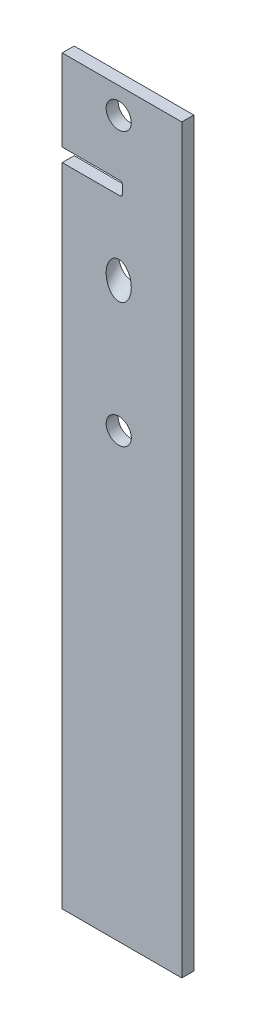
ISO-10303-21;
HEADER;
FILE_DESCRIPTION(('STEP AP214'),'2;1');
FILE_NAME('part.step','',(''),(''),'','','');
FILE_SCHEMA(('AUTOMOTIVE_DESIGN { 1 0 10303 214 1 1 1 1 }'));
ENDSEC;
DATA;
#1=APPLICATION_CONTEXT('core data for automotive mechanical design processes');
#2=APPLICATION_PROTOCOL_DEFINITION('international standard','automotive_design',2000,#1);
#3=PRODUCT_CONTEXT('',#1,'mechanical');
#4=PRODUCT('Part','Part','',(#3));
#5=PRODUCT_RELATED_PRODUCT_CATEGORY('part','',(#4));
#6=PRODUCT_DEFINITION_FORMATION('','',#4);
#7=PRODUCT_DEFINITION_CONTEXT('part definition',#1,'design');
#8=PRODUCT_DEFINITION('design','',#6,#7);
#9=PRODUCT_DEFINITION_SHAPE('','',#8);
#10=(LENGTH_UNIT() NAMED_UNIT(*) SI_UNIT(.MILLI.,.METRE.));
#11=(NAMED_UNIT(*) PLANE_ANGLE_UNIT() SI_UNIT($,.RADIAN.));
#12=(NAMED_UNIT(*) SI_UNIT($,.STERADIAN.) SOLID_ANGLE_UNIT());
#13=UNCERTAINTY_MEASURE_WITH_UNIT(LENGTH_MEASURE(1.E-05),#10,'distance_accuracy_value','');
#14=(GEOMETRIC_REPRESENTATION_CONTEXT(3) GLOBAL_UNCERTAINTY_ASSIGNED_CONTEXT((#13)) GLOBAL_UNIT_ASSIGNED_CONTEXT((#10,
#11,#12)) REPRESENTATION_CONTEXT('',''));
#15=CARTESIAN_POINT('',(0.,0.,0.));
#16=DIRECTION('',(0.,0.,1.));
#17=DIRECTION('',(1.,0.,0.));
#18=AXIS2_PLACEMENT_3D('',#15,#16,#17);
#19=CARTESIAN_POINT('',(2540.,317.5,131.142086105115));
#20=DIRECTION('',(1.,0.,0.));
#21=DIRECTION('',(0.,0.,-1.));
#22=AXIS2_PLACEMENT_3D('',#19,#20,#21);
#23=PLANE('',#22);
#24=DIRECTION('',(0.,0.,1.));
#25=VECTOR('',#24,1.);
#26=CARTESIAN_POINT('',(2540.,216.638,131.142086105115));
#27=LINE('',#26,#25);
#28=CARTESIAN_POINT('',(2540.,216.638,131.142086105115));
#29=VERTEX_POINT('',#28);
#30=CARTESIAN_POINT('',(2540.,216.638,143.842086105115));
#31=VERTEX_POINT('',#30);
#32=EDGE_CURVE('E126',#29,#31,#27,.T.);
#33=ORIENTED_EDGE('',*,*,#32,.F.);
#34=DIRECTION('',(0.,-1.,0.));
#35=VECTOR('',#34,1.);
#36=CARTESIAN_POINT('',(2540.,317.5,131.142086105115));
#37=LINE('',#36,#35);
#38=CARTESIAN_POINT('',(2540.,-469.9,131.142086105115));
#39=VERTEX_POINT('',#38);
#40=EDGE_CURVE('E121',#29,#39,#37,.T.);
#41=ORIENTED_EDGE('',*,*,#40,.T.);
#42=DIRECTION('',(0.,0.,1.));
#43=VECTOR('',#42,1.);
#44=CARTESIAN_POINT('',(2540.,-469.9,131.142086105115));
#45=LINE('',#44,#43);
#46=CARTESIAN_POINT('',(2540.,-469.9,143.842086105115));
#47=VERTEX_POINT('',#46);
#48=EDGE_CURVE('E125',#39,#47,#45,.T.);
#49=ORIENTED_EDGE('',*,*,#48,.T.);
#50=DIRECTION('',(0.,-1.,0.));
#51=VECTOR('',#50,1.);
#52=CARTESIAN_POINT('',(2540.,317.5,143.842086105115));
#53=LINE('',#52,#51);
#54=EDGE_CURVE('E245',#31,#47,#53,.T.);
#55=ORIENTED_EDGE('',*,*,#54,.F.);
#56=EDGE_LOOP('',(#33,#41,#49,#55));
#57=FACE_BOUND('',#56,.T.);
#58=ADVANCED_FACE('F44',(#57),#23,.F.);
#59=CARTESIAN_POINT('',(2540.,317.5,131.142086105115));
#60=VERTEX_POINT('',#59);
#61=CARTESIAN_POINT('',(2540.,230.862,131.142086105115));
#62=VERTEX_POINT('',#61);
#63=EDGE_CURVE('E129',#60,#62,#37,.T.);
#64=ORIENTED_EDGE('',*,*,#63,.T.);
#65=DIRECTION('',(0.,0.,1.));
#66=VECTOR('',#65,1.);
#67=CARTESIAN_POINT('',(2540.,230.862,131.142086105115));
#68=LINE('',#67,#66);
#69=CARTESIAN_POINT('',(2540.,230.862,143.842086105115));
#70=VERTEX_POINT('',#69);
#71=EDGE_CURVE('E208',#62,#70,#68,.T.);
#72=ORIENTED_EDGE('',*,*,#71,.T.);
#73=CARTESIAN_POINT('',(2540.,317.5,143.842086105115));
#74=VERTEX_POINT('',#73);
#75=EDGE_CURVE('E242',#74,#70,#53,.T.);
#76=ORIENTED_EDGE('',*,*,#75,.F.);
#77=DIRECTION('',(0.,0.,1.));
#78=VECTOR('',#77,1.);
#79=CARTESIAN_POINT('',(2540.,317.5,131.142086105115));
#80=LINE('',#79,#78);
#81=EDGE_CURVE('E168',#60,#74,#80,.T.);
#82=ORIENTED_EDGE('',*,*,#81,.F.);
#83=EDGE_LOOP('',(#64,#72,#76,#82));
#84=FACE_BOUND('',#83,.T.);
#85=ADVANCED_FACE('F253',(#84),#23,.F.);
#86=CARTESIAN_POINT('',(2540.,317.5,143.842086105115));
#87=DIRECTION('',(0.,0.,-1.));
#88=DIRECTION('',(-1.,0.,0.));
#89=AXIS2_PLACEMENT_3D('',#86,#87,#88);
#90=PLANE('',#89);
#91=CARTESIAN_POINT('',(2599.99999999996,289.999999999996,143.842086105115));
#92=DIRECTION('',(0.,0.,-1.));
#93=DIRECTION('',(-1.,0.,0.));
#94=AXIS2_PLACEMENT_3D('',#91,#92,#93);
#95=CIRCLE('',#94,13.3349999999999);
#96=CARTESIAN_POINT('',(2586.66499999996,289.999999999996,143.842086105115));
#97=VERTEX_POINT('',#96);
#98=EDGE_CURVE('E185',#97,#97,#95,.F.);
#99=ORIENTED_EDGE('',*,*,#98,.F.);
#100=EDGE_LOOP('',(#99));
#101=FACE_BOUND('',#100,.T.);
#102=ORIENTED_EDGE('',*,*,#75,.T.);
#103=DIRECTION('',(1.,0.,0.));
#104=VECTOR('',#103,1.);
#105=CARTESIAN_POINT('',(2540.,230.862,143.842086105115));
#106=LINE('',#105,#104);
#107=CARTESIAN_POINT('',(2601.087,230.862,143.842086105115));
#108=VERTEX_POINT('',#107);
#109=EDGE_CURVE('E153',#70,#108,#106,.T.);
#110=ORIENTED_EDGE('',*,*,#109,.T.);
#111=CARTESIAN_POINT('',(2601.087,227.687,143.842086105115));
#112=DIRECTION('',(0.,0.,-1.));
#113=DIRECTION('',(-1.,0.,0.));
#114=AXIS2_PLACEMENT_3D('',#111,#112,#113);
#115=CIRCLE('',#114,3.175);
#116=CARTESIAN_POINT('',(2604.262,227.687,143.842086105115));
#117=VERTEX_POINT('',#116);
#118=EDGE_CURVE('E12',#108,#117,#115,.T.);
#119=ORIENTED_EDGE('',*,*,#118,.T.);
#120=DIRECTION('',(0.,1.,0.));
#121=VECTOR('',#120,1.);
#122=CARTESIAN_POINT('',(2604.262,217.4,143.842086105115));
#123=LINE('',#122,#121);
#124=CARTESIAN_POINT('',(2604.262,219.813,143.842086105115));
#125=VERTEX_POINT('',#124);
#126=EDGE_CURVE('E205',#125,#117,#123,.T.);
#127=ORIENTED_EDGE('',*,*,#126,.F.);
#128=CARTESIAN_POINT('',(2601.087,219.813,143.842086105115));
#129=DIRECTION('',(0.,0.,-1.));
#130=DIRECTION('',(-1.,0.,0.));
#131=AXIS2_PLACEMENT_3D('',#128,#129,#130);
#132=CIRCLE('',#131,3.175);
#133=CARTESIAN_POINT('',(2601.087,216.638,143.842086105115));
#134=VERTEX_POINT('',#133);
#135=EDGE_CURVE('E232',#125,#134,#132,.T.);
#136=ORIENTED_EDGE('',*,*,#135,.T.);
#137=DIRECTION('',(1.,0.,0.));
#138=VECTOR('',#137,1.);
#139=CARTESIAN_POINT('',(2540.,216.638,143.842086105115));
#140=LINE('',#139,#138);
#141=EDGE_CURVE('E149',#31,#134,#140,.T.);
#142=ORIENTED_EDGE('',*,*,#141,.F.);
#143=ORIENTED_EDGE('',*,*,#54,.T.);
#144=DIRECTION('',(1.,0.,0.));
#145=VECTOR('',#144,1.);
#146=CARTESIAN_POINT('',(2540.,-469.9,143.842086105115));
#147=LINE('',#146,#145);
#148=CARTESIAN_POINT('',(2667.,-469.9,143.842086105114));
#149=VERTEX_POINT('',#148);
#150=EDGE_CURVE('E147',#47,#149,#147,.T.);
#151=ORIENTED_EDGE('',*,*,#150,.T.);
#152=DIRECTION('',(0.,-1.,0.));
#153=VECTOR('',#152,1.);
#154=CARTESIAN_POINT('',(2667.,317.5,143.842086105114));
#155=LINE('',#154,#153);
#156=CARTESIAN_POINT('',(2667.,317.5,143.842086105114));
#157=VERTEX_POINT('',#156);
#158=EDGE_CURVE('E142',#157,#149,#155,.T.);
#159=ORIENTED_EDGE('',*,*,#158,.F.);
#160=DIRECTION('',(1.,0.,0.));
#161=VECTOR('',#160,1.);
#162=CARTESIAN_POINT('',(2540.,317.5,143.842086105115));
#163=LINE('',#162,#161);
#164=EDGE_CURVE('E165',#74,#157,#163,.T.);
#165=ORIENTED_EDGE('',*,*,#164,.F.);
#166=EDGE_LOOP('',(#102,#110,#119,#127,#136,#142,#143,#151,#159,#165));
#167=FACE_BOUND('',#166,.T.);
#168=CARTESIAN_POINT('',(2599.99999999996,138.311981925511,143.842086105115));
#169=DIRECTION('',(0.,0.,-1.));
#170=DIRECTION('',(0.,-1.,0.));
#171=AXIS2_PLACEMENT_3D('',#168,#169,#170);
#172=ELLIPSE('',#171,19.3796877178482,13.3349999999999);
#173=CARTESIAN_POINT('',(2599.99999999996,118.932294207663,143.842086105115));
#174=VERTEX_POINT('',#173);
#175=EDGE_CURVE('E177',#174,#174,#172,.F.);
#176=ORIENTED_EDGE('',*,*,#175,.F.);
#177=EDGE_LOOP('',(#176));
#178=FACE_BOUND('',#177,.T.);
#179=CARTESIAN_POINT('',(2599.99999999996,-3.18538321897636E-12,143.842086105115));
#180=DIRECTION('',(0.,0.,-1.));
#181=DIRECTION('',(-1.,0.,0.));
#182=AXIS2_PLACEMENT_3D('',#179,#180,#181);
#183=CIRCLE('',#182,13.3349999999999);
#184=CARTESIAN_POINT('',(2586.66499999996,-3.18538321897636E-12,143.842086105115));
#185=VERTEX_POINT('',#184);
#186=EDGE_CURVE('E176',#185,#185,#183,.F.);
#187=ORIENTED_EDGE('',*,*,#186,.F.);
#188=EDGE_LOOP('',(#187));
#189=FACE_BOUND('',#188,.T.);
#190=ADVANCED_FACE('F259',(#101,#167,#178,#189),#90,.F.);
#191=CARTESIAN_POINT('',(2667.,317.5,131.142086105115));
#192=DIRECTION('',(-1.,0.,0.));
#193=DIRECTION('',(0.,0.,1.));
#194=AXIS2_PLACEMENT_3D('',#191,#192,#193);
#195=PLANE('',#194);
#196=DIRECTION('',(0.,0.,-1.));
#197=VECTOR('',#196,1.);
#198=CARTESIAN_POINT('',(2667.,-469.9,131.142086105115));
#199=LINE('',#198,#197);
#200=CARTESIAN_POINT('',(2667.,-469.9,131.142086105115));
#201=VERTEX_POINT('',#200);
#202=EDGE_CURVE('E239',#149,#201,#199,.T.);
#203=ORIENTED_EDGE('',*,*,#202,.T.);
#204=DIRECTION('',(0.,-1.,0.));
#205=VECTOR('',#204,1.);
#206=CARTESIAN_POINT('',(2667.,317.5,131.142086105115));
#207=LINE('',#206,#205);
#208=CARTESIAN_POINT('',(2667.,317.5,131.142086105115));
#209=VERTEX_POINT('',#208);
#210=EDGE_CURVE('E137',#209,#201,#207,.T.);
#211=ORIENTED_EDGE('',*,*,#210,.F.);
#212=DIRECTION('',(0.,0.,-1.));
#213=VECTOR('',#212,1.);
#214=CARTESIAN_POINT('',(2667.,317.5,131.142086105115));
#215=LINE('',#214,#213);
#216=EDGE_CURVE('E162',#157,#209,#215,.T.);
#217=ORIENTED_EDGE('',*,*,#216,.F.);
#218=ORIENTED_EDGE('',*,*,#158,.T.);
#219=EDGE_LOOP('',(#203,#211,#217,#218));
#220=FACE_BOUND('',#219,.T.);
#221=ADVANCED_FACE('F278',(#220),#195,.F.);
#222=CARTESIAN_POINT('',(2540.,317.5,131.142086105115));
#223=DIRECTION('',(0.,0.,1.));
#224=DIRECTION('',(1.,0.,0.));
#225=AXIS2_PLACEMENT_3D('',#222,#223,#224);
#226=PLANE('',#225);
#227=CARTESIAN_POINT('',(2599.99999999996,289.999999999996,131.142086105115));
#228=DIRECTION('',(0.,0.,1.));
#229=DIRECTION('',(1.,0.,0.));
#230=AXIS2_PLACEMENT_3D('',#227,#228,#229);
#231=CIRCLE('',#230,13.3349999999999);
#232=CARTESIAN_POINT('',(2613.33499999996,289.999999999996,131.142086105115));
#233=VERTEX_POINT('',#232);
#234=EDGE_CURVE('E181',#233,#233,#231,.F.);
#235=ORIENTED_EDGE('',*,*,#234,.F.);
#236=EDGE_LOOP('',(#235));
#237=FACE_BOUND('',#236,.T.);
#238=ORIENTED_EDGE('',*,*,#210,.T.);
#239=DIRECTION('',(-1.,0.,0.));
#240=VECTOR('',#239,1.);
#241=CARTESIAN_POINT('',(2540.,-469.9,131.142086105115));
#242=LINE('',#241,#240);
#243=EDGE_CURVE('E132',#201,#39,#242,.T.);
#244=ORIENTED_EDGE('',*,*,#243,.T.);
#245=ORIENTED_EDGE('',*,*,#40,.F.);
#246=DIRECTION('',(-1.,0.,0.));
#247=VECTOR('',#246,1.);
#248=CARTESIAN_POINT('',(2540.,216.638,131.142086105115));
#249=LINE('',#248,#247);
#250=CARTESIAN_POINT('',(2601.087,216.638,131.142086105115));
#251=VERTEX_POINT('',#250);
#252=EDGE_CURVE('E199',#251,#29,#249,.T.);
#253=ORIENTED_EDGE('',*,*,#252,.F.);
#254=CARTESIAN_POINT('',(2601.087,219.813,131.142086105115));
#255=DIRECTION('',(0.,0.,1.));
#256=DIRECTION('',(1.,0.,0.));
#257=AXIS2_PLACEMENT_3D('',#254,#255,#256);
#258=CIRCLE('',#257,3.175);
#259=CARTESIAN_POINT('',(2604.262,219.813,131.142086105115));
#260=VERTEX_POINT('',#259);
#261=EDGE_CURVE('E229',#251,#260,#258,.T.);
#262=ORIENTED_EDGE('',*,*,#261,.T.);
#263=DIRECTION('',(0.,1.,0.));
#264=VECTOR('',#263,1.);
#265=CARTESIAN_POINT('',(2604.262,317.5,131.142086105115));
#266=LINE('',#265,#264);
#267=CARTESIAN_POINT('',(2604.262,227.687,131.142086105115));
#268=VERTEX_POINT('',#267);
#269=EDGE_CURVE('E198',#260,#268,#266,.T.);
#270=ORIENTED_EDGE('',*,*,#269,.T.);
#271=CARTESIAN_POINT('',(2601.087,227.687,131.142086105115));
#272=DIRECTION('',(0.,0.,1.));
#273=DIRECTION('',(1.,0.,0.));
#274=AXIS2_PLACEMENT_3D('',#271,#272,#273);
#275=CIRCLE('',#274,3.175);
#276=CARTESIAN_POINT('',(2601.087,230.862,131.142086105115));
#277=VERTEX_POINT('',#276);
#278=EDGE_CURVE('E53',#268,#277,#275,.T.);
#279=ORIENTED_EDGE('',*,*,#278,.T.);
#280=DIRECTION('',(-1.,0.,0.));
#281=VECTOR('',#280,1.);
#282=CARTESIAN_POINT('',(2540.,230.862,131.142086105115));
#283=LINE('',#282,#281);
#284=EDGE_CURVE('E189',#277,#62,#283,.T.);
#285=ORIENTED_EDGE('',*,*,#284,.T.);
#286=ORIENTED_EDGE('',*,*,#63,.F.);
#287=DIRECTION('',(-1.,0.,0.));
#288=VECTOR('',#287,1.);
#289=CARTESIAN_POINT('',(2540.,317.5,131.142086105115));
#290=LINE('',#289,#288);
#291=EDGE_CURVE('E158',#209,#60,#290,.T.);
#292=ORIENTED_EDGE('',*,*,#291,.F.);
#293=EDGE_LOOP('',(#238,#244,#245,#253,#262,#270,#279,#285,#286,#292));
#294=FACE_BOUND('',#293,.T.);
#295=CARTESIAN_POINT('',(2599.99999999996,-3.08879701567193E-12,131.142086105115));
#296=DIRECTION('',(0.,0.,1.));
#297=DIRECTION('',(1.,0.,0.));
#298=AXIS2_PLACEMENT_3D('',#295,#296,#297);
#299=CIRCLE('',#298,13.3349999999999);
#300=CARTESIAN_POINT('',(2613.33499999996,-3.08879701567193E-12,131.142086105115));
#301=VERTEX_POINT('',#300);
#302=EDGE_CURVE('E172',#301,#301,#299,.F.);
#303=ORIENTED_EDGE('',*,*,#302,.F.);
#304=EDGE_LOOP('',(#303));
#305=FACE_BOUND('',#304,.T.);
#306=CARTESIAN_POINT('',(2599.99999999996,151.704709198238,131.142086105115));
#307=DIRECTION('',(0.,0.,1.));
#308=DIRECTION('',(0.,-1.,0.));
#309=AXIS2_PLACEMENT_3D('',#306,#307,#308);
#310=ELLIPSE('',#309,19.3796877178482,13.3349999999999);
#311=CARTESIAN_POINT('',(2599.99999999996,132.32502148039,131.142086105115));
#312=VERTEX_POINT('',#311);
#313=EDGE_CURVE('E161',#312,#312,#310,.F.);
#314=ORIENTED_EDGE('',*,*,#313,.F.);
#315=EDGE_LOOP('',(#314));
#316=FACE_BOUND('',#315,.T.);
#317=ADVANCED_FACE('F133',(#237,#294,#305,#316),#226,.F.);
#318=CARTESIAN_POINT('',(0.,317.5,0.));
#319=DIRECTION('',(0.,1.,0.));
#320=DIRECTION('',(0.,0.,1.));
#321=AXIS2_PLACEMENT_3D('',#318,#319,#320);
#322=PLANE('',#321);
#323=ORIENTED_EDGE('',*,*,#81,.T.);
#324=ORIENTED_EDGE('',*,*,#164,.T.);
#325=ORIENTED_EDGE('',*,*,#216,.T.);
#326=ORIENTED_EDGE('',*,*,#291,.T.);
#327=EDGE_LOOP('',(#323,#324,#325,#326));
#328=FACE_BOUND('',#327,.T.);
#329=ADVANCED_FACE('F280',(#328),#322,.T.);
#330=CARTESIAN_POINT('',(0.,-469.9,0.));
#331=DIRECTION('',(0.,1.,0.));
#332=DIRECTION('',(0.,0.,1.));
#333=AXIS2_PLACEMENT_3D('',#330,#331,#332);
#334=PLANE('',#333);
#335=ORIENTED_EDGE('',*,*,#48,.F.);
#336=ORIENTED_EDGE('',*,*,#243,.F.);
#337=ORIENTED_EDGE('',*,*,#202,.F.);
#338=ORIENTED_EDGE('',*,*,#150,.F.);
#339=EDGE_LOOP('',(#335,#336,#337,#338));
#340=FACE_BOUND('',#339,.T.);
#341=ADVANCED_FACE('F145',(#340),#334,.F.);
#342=CARTESIAN_POINT('',(2599.99999999996,289.999999999996,-4.44089209850063E-13));
#343=DIRECTION('',(0.,-0.725623851173434,0.688091583009292));
#344=DIRECTION('',(0.,-0.688091583009292,-0.725623851173434));
#345=AXIS2_PLACEMENT_3D('',#342,#343,#344);
#346=CYLINDRICAL_SURFACE('',#345,13.3349999999999);
#347=ORIENTED_EDGE('',*,*,#313,.T.);
#348=EDGE_LOOP('',(#347));
#349=FACE_BOUND('',#348,.T.);
#350=ORIENTED_EDGE('',*,*,#175,.T.);
#351=EDGE_LOOP('',(#350));
#352=FACE_BOUND('',#351,.T.);
#353=ADVANCED_FACE('F287',(#349,#352),#346,.F.);
#354=CARTESIAN_POINT('',(2599.99999999996,0.,-275.000000000001));
#355=DIRECTION('',(0.,0.,1.));
#356=DIRECTION('',(0.,-1.,0.));
#357=AXIS2_PLACEMENT_3D('',#354,#355,#356);
#358=CYLINDRICAL_SURFACE('',#357,13.3349999999999);
#359=ORIENTED_EDGE('',*,*,#302,.T.);
#360=EDGE_LOOP('',(#359));
#361=FACE_BOUND('',#360,.T.);
#362=ORIENTED_EDGE('',*,*,#186,.T.);
#363=EDGE_LOOP('',(#362));
#364=FACE_BOUND('',#363,.T.);
#365=ADVANCED_FACE('F307',(#361,#364),#358,.F.);
#366=CARTESIAN_POINT('',(2599.99999999996,289.999999999996,275.));
#367=DIRECTION('',(0.,0.,-1.));
#368=DIRECTION('',(0.,1.,0.));
#369=AXIS2_PLACEMENT_3D('',#366,#367,#368);
#370=CYLINDRICAL_SURFACE('',#369,13.3349999999999);
#371=ORIENTED_EDGE('',*,*,#234,.T.);
#372=EDGE_LOOP('',(#371));
#373=FACE_BOUND('',#372,.T.);
#374=ORIENTED_EDGE('',*,*,#98,.T.);
#375=EDGE_LOOP('',(#374));
#376=FACE_BOUND('',#375,.T.);
#377=ADVANCED_FACE('F310',(#373,#376),#370,.F.);
#378=CARTESIAN_POINT('',(0.,216.638,0.));
#379=DIRECTION('',(0.,1.,0.));
#380=DIRECTION('',(0.,0.,1.));
#381=AXIS2_PLACEMENT_3D('',#378,#379,#380);
#382=PLANE('',#381);
#383=ORIENTED_EDGE('',*,*,#141,.T.);
#384=DIRECTION('',(0.,0.,-1.));
#385=VECTOR('',#384,1.);
#386=CARTESIAN_POINT('',(2601.087,216.638,0.));
#387=LINE('',#386,#385);
#388=EDGE_CURVE('E202',#134,#251,#387,.T.);
#389=ORIENTED_EDGE('',*,*,#388,.T.);
#390=ORIENTED_EDGE('',*,*,#252,.T.);
#391=ORIENTED_EDGE('',*,*,#32,.T.);
#392=EDGE_LOOP('',(#383,#389,#390,#391));
#393=FACE_BOUND('',#392,.T.);
#394=ADVANCED_FACE('F273',(#393),#382,.T.);
#395=CARTESIAN_POINT('',(0.,230.862,0.));
#396=DIRECTION('',(0.,1.,0.));
#397=DIRECTION('',(0.,0.,1.));
#398=AXIS2_PLACEMENT_3D('',#395,#396,#397);
#399=PLANE('',#398);
#400=ORIENTED_EDGE('',*,*,#284,.F.);
#401=DIRECTION('',(0.,0.,-1.));
#402=VECTOR('',#401,1.);
#403=CARTESIAN_POINT('',(2601.087,230.862,143.842086105115));
#404=LINE('',#403,#402);
#405=EDGE_CURVE('E60',#277,#108,#404,.F.);
#406=ORIENTED_EDGE('',*,*,#405,.T.);
#407=ORIENTED_EDGE('',*,*,#109,.F.);
#408=ORIENTED_EDGE('',*,*,#71,.F.);
#409=EDGE_LOOP('',(#400,#406,#407,#408));
#410=FACE_BOUND('',#409,.T.);
#411=ADVANCED_FACE('F256',(#410),#399,.F.);
#412=CARTESIAN_POINT('',(2604.262,217.4,143.842086105115));
#413=DIRECTION('',(1.,0.,0.));
#414=DIRECTION('',(0.,0.,-1.));
#415=AXIS2_PLACEMENT_3D('',#412,#413,#414);
#416=PLANE('',#415);
#417=ORIENTED_EDGE('',*,*,#269,.F.);
#418=DIRECTION('',(0.,0.,-1.));
#419=VECTOR('',#418,1.);
#420=CARTESIAN_POINT('',(2604.262,219.813,143.842086105115));
#421=LINE('',#420,#419);
#422=EDGE_CURVE('E224',#260,#125,#421,.F.);
#423=ORIENTED_EDGE('',*,*,#422,.T.);
#424=ORIENTED_EDGE('',*,*,#126,.T.);
#425=DIRECTION('',(0.,0.,-1.));
#426=VECTOR('',#425,1.);
#427=CARTESIAN_POINT('',(2604.262,227.687,131.142086105115));
#428=LINE('',#427,#426);
#429=EDGE_CURVE('E220',#117,#268,#428,.T.);
#430=ORIENTED_EDGE('',*,*,#429,.T.);
#431=EDGE_LOOP('',(#417,#423,#424,#430));
#432=FACE_BOUND('',#431,.T.);
#433=ADVANCED_FACE('F266',(#432),#416,.F.);
#434=CARTESIAN_POINT('',(2601.087,219.813,0.));
#435=DIRECTION('',(0.,0.,-1.));
#436=DIRECTION('',(-1.,0.,0.));
#437=AXIS2_PLACEMENT_3D('',#434,#435,#436);
#438=CYLINDRICAL_SURFACE('',#437,3.175);
#439=ORIENTED_EDGE('',*,*,#135,.F.);
#440=ORIENTED_EDGE('',*,*,#422,.F.);
#441=ORIENTED_EDGE('',*,*,#261,.F.);
#442=ORIENTED_EDGE('',*,*,#388,.F.);
#443=EDGE_LOOP('',(#439,#440,#441,#442));
#444=FACE_BOUND('',#443,.T.);
#445=ADVANCED_FACE('F271',(#444),#438,.F.);
#446=CARTESIAN_POINT('',(2601.087,227.687,143.842086105115));
#447=DIRECTION('',(0.,0.,1.));
#448=DIRECTION('',(1.,0.,0.));
#449=AXIS2_PLACEMENT_3D('',#446,#447,#448);
#450=CYLINDRICAL_SURFACE('',#449,3.175);
#451=ORIENTED_EDGE('',*,*,#118,.F.);
#452=ORIENTED_EDGE('',*,*,#405,.F.);
#453=ORIENTED_EDGE('',*,*,#278,.F.);
#454=ORIENTED_EDGE('',*,*,#429,.F.);
#455=EDGE_LOOP('',(#451,#452,#453,#454));
#456=FACE_BOUND('',#455,.T.);
#457=ADVANCED_FACE('F46',(#456),#450,.F.);
#458=CLOSED_SHELL('',(#58,#85,#190,#221,#317,#329,#341,#353,#365,#377,#394,#411,#433,#445,#457));
#459=MANIFOLD_SOLID_BREP('B2',#458);
#460=ADVANCED_BREP_SHAPE_REPRESENTATION('',(#18,#459),#14);
#461=SHAPE_DEFINITION_REPRESENTATION(#9,#460);
ENDSEC;
END-ISO-10303-21;
